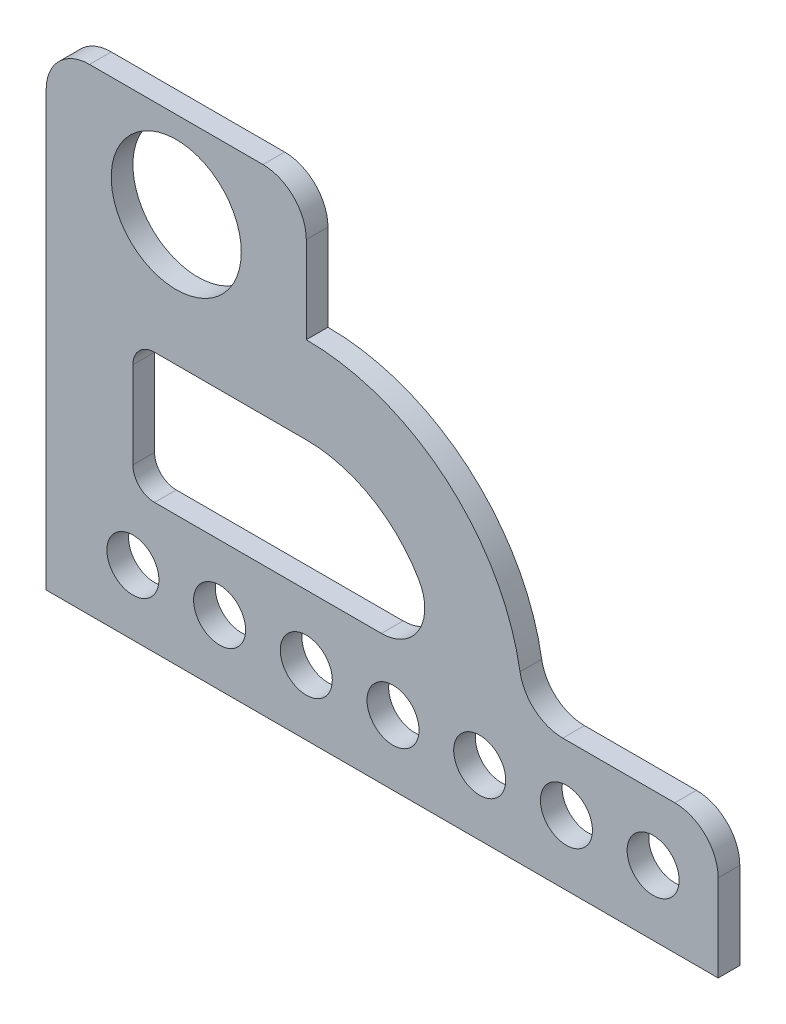
ISO-10303-21;
HEADER;
FILE_DESCRIPTION(('STEP AP214'),'2;1');
FILE_NAME('part.step','',(''),(''),'','','');
FILE_SCHEMA(('AUTOMOTIVE_DESIGN { 1 0 10303 214 1 1 1 1 }'));
ENDSEC;
DATA;
#1=APPLICATION_CONTEXT('core data for automotive mechanical design processes');
#2=APPLICATION_PROTOCOL_DEFINITION('international standard','automotive_design',2000,#1);
#3=PRODUCT_CONTEXT('',#1,'mechanical');
#4=PRODUCT('Part','Part','',(#3));
#5=PRODUCT_RELATED_PRODUCT_CATEGORY('part','',(#4));
#6=PRODUCT_DEFINITION_FORMATION('','',#4);
#7=PRODUCT_DEFINITION_CONTEXT('part definition',#1,'design');
#8=PRODUCT_DEFINITION('design','',#6,#7);
#9=PRODUCT_DEFINITION_SHAPE('','',#8);
#10=(LENGTH_UNIT() NAMED_UNIT(*) SI_UNIT(.MILLI.,.METRE.));
#11=(NAMED_UNIT(*) PLANE_ANGLE_UNIT() SI_UNIT($,.RADIAN.));
#12=(NAMED_UNIT(*) SI_UNIT($,.STERADIAN.) SOLID_ANGLE_UNIT());
#13=UNCERTAINTY_MEASURE_WITH_UNIT(LENGTH_MEASURE(1.E-05),#10,'distance_accuracy_value','');
#14=(GEOMETRIC_REPRESENTATION_CONTEXT(3) GLOBAL_UNCERTAINTY_ASSIGNED_CONTEXT((#13)) GLOBAL_UNIT_ASSIGNED_CONTEXT((#10,
#11,#12)) REPRESENTATION_CONTEXT('',''));
#15=CARTESIAN_POINT('',(0.,0.,0.));
#16=DIRECTION('',(0.,0.,1.));
#17=DIRECTION('',(1.,0.,0.));
#18=AXIS2_PLACEMENT_3D('',#15,#16,#17);
#19=CARTESIAN_POINT('',(-10.,20.,5.));
#20=DIRECTION('',(0.,0.,1.));
#21=DIRECTION('',(1.,0.,0.));
#22=AXIS2_PLACEMENT_3D('',#19,#20,#21);
#23=PLANE('',#22);
#24=CARTESIAN_POINT('',(-35.,15.,5.));
#25=DIRECTION('',(0.,0.,1.));
#26=DIRECTION('',(1.,0.,0.));
#27=AXIS2_PLACEMENT_3D('',#24,#25,#26);
#28=CIRCLE('',#27,6.00000000000002);
#29=CARTESIAN_POINT('',(-29.,15.,5.));
#30=VERTEX_POINT('',#29);
#31=EDGE_CURVE('E613',#30,#30,#28,.T.);
#32=ORIENTED_EDGE('',*,*,#31,.F.);
#33=EDGE_LOOP('',(#32));
#34=FACE_BOUND('',#33,.T.);
#35=CARTESIAN_POINT('',(-75.,15.,5.));
#36=DIRECTION('',(0.,0.,1.));
#37=DIRECTION('',(1.,0.,0.));
#38=AXIS2_PLACEMENT_3D('',#35,#36,#37);
#39=CIRCLE('',#38,6.00000000000002);
#40=CARTESIAN_POINT('',(-69.,15.,5.));
#41=VERTEX_POINT('',#40);
#42=EDGE_CURVE('E625',#41,#41,#39,.T.);
#43=ORIENTED_EDGE('',*,*,#42,.F.);
#44=EDGE_LOOP('',(#43));
#45=FACE_BOUND('',#44,.T.);
#46=CARTESIAN_POINT('',(-115.,15.,5.));
#47=DIRECTION('',(0.,0.,1.));
#48=DIRECTION('',(1.,0.,0.));
#49=AXIS2_PLACEMENT_3D('',#46,#47,#48);
#50=CIRCLE('',#49,6.00000000000002);
#51=CARTESIAN_POINT('',(-109.,15.,5.));
#52=VERTEX_POINT('',#51);
#53=EDGE_CURVE('E637',#52,#52,#50,.T.);
#54=ORIENTED_EDGE('',*,*,#53,.F.);
#55=EDGE_LOOP('',(#54));
#56=FACE_BOUND('',#55,.T.);
#57=CARTESIAN_POINT('',(-125.,90.,5.));
#58=DIRECTION('',(0.,0.,1.));
#59=DIRECTION('',(1.,0.,0.));
#60=AXIS2_PLACEMENT_3D('',#57,#58,#59);
#61=CIRCLE('',#60,15.);
#62=CARTESIAN_POINT('',(-110.,90.,5.));
#63=VERTEX_POINT('',#62);
#64=EDGE_CURVE('E193',#63,#63,#61,.T.);
#65=ORIENTED_EDGE('',*,*,#64,.F.);
#66=EDGE_LOOP('',(#65));
#67=FACE_BOUND('',#66,.T.);
#68=DIRECTION('',(0.,1.,0.));
#69=VECTOR('',#68,1.);
#70=CARTESIAN_POINT('',(0.,0.,5.));
#71=LINE('',#70,#69);
#72=CARTESIAN_POINT('',(0.,0.,5.));
#73=VERTEX_POINT('',#72);
#74=CARTESIAN_POINT('',(0.,19.9999999999999,5.));
#75=VERTEX_POINT('',#74);
#76=EDGE_CURVE('E219',#73,#75,#71,.T.);
#77=ORIENTED_EDGE('',*,*,#76,.T.);
#78=CARTESIAN_POINT('',(-10.,20.,5.));
#79=DIRECTION('',(0.,0.,1.));
#80=DIRECTION('',(1.,0.,0.));
#81=AXIS2_PLACEMENT_3D('',#78,#79,#80);
#82=CIRCLE('',#81,10.);
#83=CARTESIAN_POINT('',(-10.0000000000001,30.,5.));
#84=VERTEX_POINT('',#83);
#85=EDGE_CURVE('E222',#75,#84,#82,.T.);
#86=ORIENTED_EDGE('',*,*,#85,.T.);
#87=DIRECTION('',(-1.,0.,0.));
#88=VECTOR('',#87,1.);
#89=CARTESIAN_POINT('',(-35.8392021690038,30.,5.));
#90=LINE('',#89,#88);
#91=CARTESIAN_POINT('',(-35.8392021690038,30.,5.));
#92=VERTEX_POINT('',#91);
#93=EDGE_CURVE('E225',#84,#92,#90,.T.);
#94=ORIENTED_EDGE('',*,*,#93,.T.);
#95=CARTESIAN_POINT('',(-35.8392021690038,40.,5.));
#96=DIRECTION('',(0.,0.,-1.));
#97=DIRECTION('',(-1.,0.,0.));
#98=AXIS2_PLACEMENT_3D('',#95,#96,#97);
#99=CIRCLE('',#98,9.99999999999999);
#100=CARTESIAN_POINT('',(-45.6993351408365,38.3333333333333,5.));
#101=VERTEX_POINT('',#100);
#102=EDGE_CURVE('E227',#92,#101,#99,.T.);
#103=ORIENTED_EDGE('',*,*,#102,.T.);
#104=CARTESIAN_POINT('',(-95.,30.,5.));
#105=DIRECTION('',(0.,0.,1.));
#106=DIRECTION('',(1.,0.,0.));
#107=AXIS2_PLACEMENT_3D('',#104,#105,#106);
#108=CIRCLE('',#107,50.);
#109=CARTESIAN_POINT('',(-95.,80.,5.));
#110=VERTEX_POINT('',#109);
#111=EDGE_CURVE('E229',#101,#110,#108,.T.);
#112=ORIENTED_EDGE('',*,*,#111,.T.);
#113=DIRECTION('',(0.,1.,0.));
#114=VECTOR('',#113,1.);
#115=CARTESIAN_POINT('',(-95.,99.9999999999999,5.));
#116=LINE('',#115,#114);
#117=CARTESIAN_POINT('',(-95.,99.9999999999999,5.));
#118=VERTEX_POINT('',#117);
#119=EDGE_CURVE('E231',#110,#118,#116,.T.);
#120=ORIENTED_EDGE('',*,*,#119,.T.);
#121=CARTESIAN_POINT('',(-105.,100.,5.));
#122=DIRECTION('',(0.,0.,1.));
#123=DIRECTION('',(-1.,0.,0.));
#124=AXIS2_PLACEMENT_3D('',#121,#122,#123);
#125=CIRCLE('',#124,9.99999999999999);
#126=CARTESIAN_POINT('',(-105.,110.,5.));
#127=VERTEX_POINT('',#126);
#128=EDGE_CURVE('E233',#118,#127,#125,.T.);
#129=ORIENTED_EDGE('',*,*,#128,.T.);
#130=DIRECTION('',(-1.,0.,0.));
#131=VECTOR('',#130,1.);
#132=CARTESIAN_POINT('',(-145.,110.,5.));
#133=LINE('',#132,#131);
#134=CARTESIAN_POINT('',(-145.,110.,5.));
#135=VERTEX_POINT('',#134);
#136=EDGE_CURVE('E235',#127,#135,#133,.T.);
#137=ORIENTED_EDGE('',*,*,#136,.T.);
#138=CARTESIAN_POINT('',(-145.,100.,5.));
#139=DIRECTION('',(0.,0.,1.));
#140=DIRECTION('',(-1.,0.,0.));
#141=AXIS2_PLACEMENT_3D('',#138,#139,#140);
#142=CIRCLE('',#141,10.);
#143=CARTESIAN_POINT('',(-155.,99.9999999999999,5.));
#144=VERTEX_POINT('',#143);
#145=EDGE_CURVE('E237',#135,#144,#142,.T.);
#146=ORIENTED_EDGE('',*,*,#145,.T.);
#147=DIRECTION('',(0.,-1.,0.));
#148=VECTOR('',#147,1.);
#149=CARTESIAN_POINT('',(-155.,0.,5.));
#150=LINE('',#149,#148);
#151=CARTESIAN_POINT('',(-155.,0.,5.));
#152=VERTEX_POINT('',#151);
#153=EDGE_CURVE('E239',#144,#152,#150,.T.);
#154=ORIENTED_EDGE('',*,*,#153,.T.);
#155=DIRECTION('',(1.,0.,0.));
#156=VECTOR('',#155,1.);
#157=CARTESIAN_POINT('',(0.,0.,5.));
#158=LINE('',#157,#156);
#159=EDGE_CURVE('E241',#152,#73,#158,.T.);
#160=ORIENTED_EDGE('',*,*,#159,.T.);
#161=EDGE_LOOP('',(#77,#86,#94,#103,#112,#120,#129,#137,#146,#154,#160));
#162=FACE_BOUND('',#161,.T.);
#163=CARTESIAN_POINT('',(-95.,30.,5.));
#164=DIRECTION('',(0.,0.,1.));
#165=DIRECTION('',(1.,0.,0.));
#166=AXIS2_PLACEMENT_3D('',#163,#164,#165);
#167=CIRCLE('',#166,30.);
#168=CARTESIAN_POINT('',(-69.0192378864668,45.,5.));
#169=VERTEX_POINT('',#168);
#170=CARTESIAN_POINT('',(-95.,60.,5.));
#171=VERTEX_POINT('',#170);
#172=EDGE_CURVE('E178',#169,#171,#167,.T.);
#173=ORIENTED_EDGE('',*,*,#172,.F.);
#174=CARTESIAN_POINT('',(-77.6794919243112,40.,5.));
#175=DIRECTION('',(0.,0.,1.));
#176=DIRECTION('',(1.,0.,0.));
#177=AXIS2_PLACEMENT_3D('',#174,#175,#176);
#178=CIRCLE('',#177,10.);
#179=CARTESIAN_POINT('',(-77.6794919243112,30.,5.));
#180=VERTEX_POINT('',#179);
#181=EDGE_CURVE('E163',#180,#169,#178,.T.);
#182=ORIENTED_EDGE('',*,*,#181,.F.);
#183=DIRECTION('',(1.,0.,0.));
#184=VECTOR('',#183,1.);
#185=CARTESIAN_POINT('',(-95.,30.,5.));
#186=LINE('',#185,#184);
#187=CARTESIAN_POINT('',(-130.,30.,5.));
#188=VERTEX_POINT('',#187);
#189=EDGE_CURVE('E158',#188,#180,#186,.T.);
#190=ORIENTED_EDGE('',*,*,#189,.F.);
#191=CARTESIAN_POINT('',(-130.,35.,5.));
#192=DIRECTION('',(0.,0.,1.));
#193=DIRECTION('',(-1.,0.,0.));
#194=AXIS2_PLACEMENT_3D('',#191,#192,#193);
#195=CIRCLE('',#194,5.);
#196=CARTESIAN_POINT('',(-135.,35.,5.));
#197=VERTEX_POINT('',#196);
#198=EDGE_CURVE('E189',#197,#188,#195,.T.);
#199=ORIENTED_EDGE('',*,*,#198,.F.);
#200=DIRECTION('',(0.,-1.,0.));
#201=VECTOR('',#200,1.);
#202=CARTESIAN_POINT('',(-135.,55.,5.));
#203=LINE('',#202,#201);
#204=CARTESIAN_POINT('',(-135.,55.,5.));
#205=VERTEX_POINT('',#204);
#206=EDGE_CURVE('E187',#205,#197,#203,.T.);
#207=ORIENTED_EDGE('',*,*,#206,.F.);
#208=CARTESIAN_POINT('',(-130.,55.,5.));
#209=DIRECTION('',(0.,0.,1.));
#210=DIRECTION('',(-1.,0.,0.));
#211=AXIS2_PLACEMENT_3D('',#208,#209,#210);
#212=CIRCLE('',#211,5.);
#213=CARTESIAN_POINT('',(-130.,60.,5.));
#214=VERTEX_POINT('',#213);
#215=EDGE_CURVE('E185',#214,#205,#212,.T.);
#216=ORIENTED_EDGE('',*,*,#215,.F.);
#217=DIRECTION('',(-1.,0.,0.));
#218=VECTOR('',#217,1.);
#219=CARTESIAN_POINT('',(-95.,60.,5.));
#220=LINE('',#219,#218);
#221=EDGE_CURVE('E180',#171,#214,#220,.T.);
#222=ORIENTED_EDGE('',*,*,#221,.F.);
#223=EDGE_LOOP('',(#173,#182,#190,#199,#207,#216,#222));
#224=FACE_BOUND('',#223,.T.);
#225=CARTESIAN_POINT('',(-135.,15.,5.));
#226=DIRECTION('',(0.,0.,1.));
#227=DIRECTION('',(1.,0.,0.));
#228=AXIS2_PLACEMENT_3D('',#225,#226,#227);
#229=CIRCLE('',#228,6.00000000000002);
#230=CARTESIAN_POINT('',(-129.,15.,5.));
#231=VERTEX_POINT('',#230);
#232=EDGE_CURVE('E643',#231,#231,#229,.T.);
#233=ORIENTED_EDGE('',*,*,#232,.F.);
#234=EDGE_LOOP('',(#233));
#235=FACE_BOUND('',#234,.T.);
#236=CARTESIAN_POINT('',(-95.,15.,5.));
#237=DIRECTION('',(0.,0.,1.));
#238=DIRECTION('',(1.,0.,0.));
#239=AXIS2_PLACEMENT_3D('',#236,#237,#238);
#240=CIRCLE('',#239,6.00000000000002);
#241=CARTESIAN_POINT('',(-89.,15.,5.));
#242=VERTEX_POINT('',#241);
#243=EDGE_CURVE('E631',#242,#242,#240,.T.);
#244=ORIENTED_EDGE('',*,*,#243,.F.);
#245=EDGE_LOOP('',(#244));
#246=FACE_BOUND('',#245,.T.);
#247=CARTESIAN_POINT('',(-55.,15.,5.));
#248=DIRECTION('',(0.,0.,1.));
#249=DIRECTION('',(1.,0.,0.));
#250=AXIS2_PLACEMENT_3D('',#247,#248,#249);
#251=CIRCLE('',#250,6.00000000000002);
#252=CARTESIAN_POINT('',(-49.,15.,5.));
#253=VERTEX_POINT('',#252);
#254=EDGE_CURVE('E619',#253,#253,#251,.T.);
#255=ORIENTED_EDGE('',*,*,#254,.F.);
#256=EDGE_LOOP('',(#255));
#257=FACE_BOUND('',#256,.T.);
#258=CARTESIAN_POINT('',(-15.,15.,5.));
#259=DIRECTION('',(0.,0.,1.));
#260=DIRECTION('',(1.,0.,0.));
#261=AXIS2_PLACEMENT_3D('',#258,#259,#260);
#262=CIRCLE('',#261,6.00000000000002);
#263=CARTESIAN_POINT('',(-8.99999999999997,15.,5.));
#264=VERTEX_POINT('',#263);
#265=EDGE_CURVE('E604',#264,#264,#262,.T.);
#266=ORIENTED_EDGE('',*,*,#265,.F.);
#267=EDGE_LOOP('',(#266));
#268=FACE_BOUND('',#267,.T.);
#269=ADVANCED_FACE('F36',(#34,#45,#56,#67,#162,#224,#235,#246,#257,#268),#23,.T.);
#270=CARTESIAN_POINT('',(-10.,20.,0.));
#271=DIRECTION('',(0.,0.,1.));
#272=DIRECTION('',(1.,0.,0.));
#273=AXIS2_PLACEMENT_3D('',#270,#271,#272);
#274=PLANE('',#273);
#275=DIRECTION('',(0.,1.,0.));
#276=VECTOR('',#275,1.);
#277=CARTESIAN_POINT('',(0.,0.,0.));
#278=LINE('',#277,#276);
#279=CARTESIAN_POINT('',(0.,0.,0.));
#280=VERTEX_POINT('',#279);
#281=CARTESIAN_POINT('',(0.,19.9999999999999,0.));
#282=VERTEX_POINT('',#281);
#283=EDGE_CURVE('E172',#280,#282,#278,.T.);
#284=ORIENTED_EDGE('',*,*,#283,.F.);
#285=DIRECTION('',(1.,0.,0.));
#286=VECTOR('',#285,1.);
#287=CARTESIAN_POINT('',(0.,0.,0.));
#288=LINE('',#287,#286);
#289=CARTESIAN_POINT('',(-155.,0.,0.));
#290=VERTEX_POINT('',#289);
#291=EDGE_CURVE('E223',#290,#280,#288,.T.);
#292=ORIENTED_EDGE('',*,*,#291,.F.);
#293=DIRECTION('',(0.,-1.,0.));
#294=VECTOR('',#293,1.);
#295=CARTESIAN_POINT('',(-155.,0.,0.));
#296=LINE('',#295,#294);
#297=CARTESIAN_POINT('',(-155.,99.9999999999999,0.));
#298=VERTEX_POINT('',#297);
#299=EDGE_CURVE('E262',#298,#290,#296,.T.);
#300=ORIENTED_EDGE('',*,*,#299,.F.);
#301=CARTESIAN_POINT('',(-145.,100.,0.));
#302=DIRECTION('',(0.,0.,1.));
#303=DIRECTION('',(-1.,0.,0.));
#304=AXIS2_PLACEMENT_3D('',#301,#302,#303);
#305=CIRCLE('',#304,10.);
#306=CARTESIAN_POINT('',(-145.,110.,0.));
#307=VERTEX_POINT('',#306);
#308=EDGE_CURVE('E260',#307,#298,#305,.T.);
#309=ORIENTED_EDGE('',*,*,#308,.F.);
#310=DIRECTION('',(-1.,0.,0.));
#311=VECTOR('',#310,1.);
#312=CARTESIAN_POINT('',(-145.,110.,0.));
#313=LINE('',#312,#311);
#314=CARTESIAN_POINT('',(-105.,110.,0.));
#315=VERTEX_POINT('',#314);
#316=EDGE_CURVE('E258',#315,#307,#313,.T.);
#317=ORIENTED_EDGE('',*,*,#316,.F.);
#318=CARTESIAN_POINT('',(-105.,100.,0.));
#319=DIRECTION('',(0.,0.,1.));
#320=DIRECTION('',(-1.,0.,0.));
#321=AXIS2_PLACEMENT_3D('',#318,#319,#320);
#322=CIRCLE('',#321,9.99999999999999);
#323=CARTESIAN_POINT('',(-95.,99.9999999999999,0.));
#324=VERTEX_POINT('',#323);
#325=EDGE_CURVE('E256',#324,#315,#322,.T.);
#326=ORIENTED_EDGE('',*,*,#325,.F.);
#327=DIRECTION('',(0.,1.,0.));
#328=VECTOR('',#327,1.);
#329=CARTESIAN_POINT('',(-95.,99.9999999999999,0.));
#330=LINE('',#329,#328);
#331=CARTESIAN_POINT('',(-95.,80.,0.));
#332=VERTEX_POINT('',#331);
#333=EDGE_CURVE('E254',#332,#324,#330,.T.);
#334=ORIENTED_EDGE('',*,*,#333,.F.);
#335=CARTESIAN_POINT('',(-95.,30.,0.));
#336=DIRECTION('',(0.,0.,1.));
#337=DIRECTION('',(1.,0.,0.));
#338=AXIS2_PLACEMENT_3D('',#335,#336,#337);
#339=CIRCLE('',#338,50.);
#340=CARTESIAN_POINT('',(-45.6993351408365,38.3333333333333,0.));
#341=VERTEX_POINT('',#340);
#342=EDGE_CURVE('E252',#341,#332,#339,.T.);
#343=ORIENTED_EDGE('',*,*,#342,.F.);
#344=CARTESIAN_POINT('',(-35.8392021690038,40.,0.));
#345=DIRECTION('',(0.,0.,-1.));
#346=DIRECTION('',(-1.,0.,0.));
#347=AXIS2_PLACEMENT_3D('',#344,#345,#346);
#348=CIRCLE('',#347,9.99999999999999);
#349=CARTESIAN_POINT('',(-35.8392021690038,30.,0.));
#350=VERTEX_POINT('',#349);
#351=EDGE_CURVE('E250',#350,#341,#348,.T.);
#352=ORIENTED_EDGE('',*,*,#351,.F.);
#353=DIRECTION('',(-1.,0.,0.));
#354=VECTOR('',#353,1.);
#355=CARTESIAN_POINT('',(-35.8392021690038,30.,0.));
#356=LINE('',#355,#354);
#357=CARTESIAN_POINT('',(-10.0000000000001,30.,0.));
#358=VERTEX_POINT('',#357);
#359=EDGE_CURVE('E248',#358,#350,#356,.T.);
#360=ORIENTED_EDGE('',*,*,#359,.F.);
#361=CARTESIAN_POINT('',(-10.,20.,0.));
#362=DIRECTION('',(0.,0.,1.));
#363=DIRECTION('',(1.,0.,0.));
#364=AXIS2_PLACEMENT_3D('',#361,#362,#363);
#365=CIRCLE('',#364,10.);
#366=EDGE_CURVE('E246',#282,#358,#365,.T.);
#367=ORIENTED_EDGE('',*,*,#366,.F.);
#368=EDGE_LOOP('',(#284,#292,#300,#309,#317,#326,#334,#343,#352,#360,#367));
#369=FACE_BOUND('',#368,.T.);
#370=CARTESIAN_POINT('',(-77.6794919243112,40.,0.));
#371=DIRECTION('',(0.,0.,1.));
#372=DIRECTION('',(1.,0.,0.));
#373=AXIS2_PLACEMENT_3D('',#370,#371,#372);
#374=CIRCLE('',#373,10.);
#375=CARTESIAN_POINT('',(-77.6794919243112,30.,0.));
#376=VERTEX_POINT('',#375);
#377=CARTESIAN_POINT('',(-69.0192378864668,45.,0.));
#378=VERTEX_POINT('',#377);
#379=EDGE_CURVE('E170',#376,#378,#374,.T.);
#380=ORIENTED_EDGE('',*,*,#379,.T.);
#381=CARTESIAN_POINT('',(-95.,30.,0.));
#382=DIRECTION('',(0.,0.,1.));
#383=DIRECTION('',(1.,0.,0.));
#384=AXIS2_PLACEMENT_3D('',#381,#382,#383);
#385=CIRCLE('',#384,30.);
#386=CARTESIAN_POINT('',(-95.,60.,0.));
#387=VERTEX_POINT('',#386);
#388=EDGE_CURVE('E192',#378,#387,#385,.T.);
#389=ORIENTED_EDGE('',*,*,#388,.T.);
#390=DIRECTION('',(-1.,0.,0.));
#391=VECTOR('',#390,1.);
#392=CARTESIAN_POINT('',(-95.,60.,0.));
#393=LINE('',#392,#391);
#394=CARTESIAN_POINT('',(-130.,60.,0.));
#395=VERTEX_POINT('',#394);
#396=EDGE_CURVE('E196',#387,#395,#393,.T.);
#397=ORIENTED_EDGE('',*,*,#396,.T.);
#398=CARTESIAN_POINT('',(-130.,55.,0.));
#399=DIRECTION('',(0.,0.,1.));
#400=DIRECTION('',(-1.,0.,0.));
#401=AXIS2_PLACEMENT_3D('',#398,#399,#400);
#402=CIRCLE('',#401,5.);
#403=CARTESIAN_POINT('',(-135.,55.,0.));
#404=VERTEX_POINT('',#403);
#405=EDGE_CURVE('E199',#395,#404,#402,.T.);
#406=ORIENTED_EDGE('',*,*,#405,.T.);
#407=DIRECTION('',(0.,-1.,0.));
#408=VECTOR('',#407,1.);
#409=CARTESIAN_POINT('',(-135.,55.,0.));
#410=LINE('',#409,#408);
#411=CARTESIAN_POINT('',(-135.,35.,0.));
#412=VERTEX_POINT('',#411);
#413=EDGE_CURVE('E202',#404,#412,#410,.T.);
#414=ORIENTED_EDGE('',*,*,#413,.T.);
#415=CARTESIAN_POINT('',(-130.,35.,0.));
#416=DIRECTION('',(0.,0.,1.));
#417=DIRECTION('',(-1.,0.,0.));
#418=AXIS2_PLACEMENT_3D('',#415,#416,#417);
#419=CIRCLE('',#418,5.);
#420=CARTESIAN_POINT('',(-130.,30.,0.));
#421=VERTEX_POINT('',#420);
#422=EDGE_CURVE('E205',#412,#421,#419,.T.);
#423=ORIENTED_EDGE('',*,*,#422,.T.);
#424=DIRECTION('',(1.,0.,0.));
#425=VECTOR('',#424,1.);
#426=CARTESIAN_POINT('',(-130.,30.,0.));
#427=LINE('',#426,#425);
#428=EDGE_CURVE('E164',#421,#376,#427,.T.);
#429=ORIENTED_EDGE('',*,*,#428,.T.);
#430=EDGE_LOOP('',(#380,#389,#397,#406,#414,#423,#429));
#431=FACE_BOUND('',#430,.T.);
#432=CARTESIAN_POINT('',(-125.,90.,0.));
#433=DIRECTION('',(0.,0.,1.));
#434=DIRECTION('',(1.,0.,0.));
#435=AXIS2_PLACEMENT_3D('',#432,#433,#434);
#436=CIRCLE('',#435,15.);
#437=CARTESIAN_POINT('',(-110.,90.,0.));
#438=VERTEX_POINT('',#437);
#439=EDGE_CURVE('E646',#438,#438,#436,.T.);
#440=ORIENTED_EDGE('',*,*,#439,.T.);
#441=EDGE_LOOP('',(#440));
#442=FACE_BOUND('',#441,.T.);
#443=CARTESIAN_POINT('',(-135.,15.,0.));
#444=DIRECTION('',(0.,0.,1.));
#445=DIRECTION('',(1.,0.,0.));
#446=AXIS2_PLACEMENT_3D('',#443,#444,#445);
#447=CIRCLE('',#446,6.00000000000002);
#448=CARTESIAN_POINT('',(-129.,15.,0.));
#449=VERTEX_POINT('',#448);
#450=EDGE_CURVE('E640',#449,#449,#447,.T.);
#451=ORIENTED_EDGE('',*,*,#450,.T.);
#452=EDGE_LOOP('',(#451));
#453=FACE_BOUND('',#452,.T.);
#454=CARTESIAN_POINT('',(-115.,15.,0.));
#455=DIRECTION('',(0.,0.,1.));
#456=DIRECTION('',(1.,0.,0.));
#457=AXIS2_PLACEMENT_3D('',#454,#455,#456);
#458=CIRCLE('',#457,6.00000000000002);
#459=CARTESIAN_POINT('',(-109.,15.,0.));
#460=VERTEX_POINT('',#459);
#461=EDGE_CURVE('E634',#460,#460,#458,.T.);
#462=ORIENTED_EDGE('',*,*,#461,.T.);
#463=EDGE_LOOP('',(#462));
#464=FACE_BOUND('',#463,.T.);
#465=CARTESIAN_POINT('',(-95.,15.,0.));
#466=DIRECTION('',(0.,0.,1.));
#467=DIRECTION('',(1.,0.,0.));
#468=AXIS2_PLACEMENT_3D('',#465,#466,#467);
#469=CIRCLE('',#468,6.00000000000002);
#470=CARTESIAN_POINT('',(-89.,15.,0.));
#471=VERTEX_POINT('',#470);
#472=EDGE_CURVE('E628',#471,#471,#469,.T.);
#473=ORIENTED_EDGE('',*,*,#472,.T.);
#474=EDGE_LOOP('',(#473));
#475=FACE_BOUND('',#474,.T.);
#476=CARTESIAN_POINT('',(-75.,15.,0.));
#477=DIRECTION('',(0.,0.,1.));
#478=DIRECTION('',(1.,0.,0.));
#479=AXIS2_PLACEMENT_3D('',#476,#477,#478);
#480=CIRCLE('',#479,6.00000000000002);
#481=CARTESIAN_POINT('',(-69.,15.,0.));
#482=VERTEX_POINT('',#481);
#483=EDGE_CURVE('E622',#482,#482,#480,.T.);
#484=ORIENTED_EDGE('',*,*,#483,.T.);
#485=EDGE_LOOP('',(#484));
#486=FACE_BOUND('',#485,.T.);
#487=CARTESIAN_POINT('',(-55.,15.,0.));
#488=DIRECTION('',(0.,0.,1.));
#489=DIRECTION('',(1.,0.,0.));
#490=AXIS2_PLACEMENT_3D('',#487,#488,#489);
#491=CIRCLE('',#490,6.00000000000002);
#492=CARTESIAN_POINT('',(-49.,15.,0.));
#493=VERTEX_POINT('',#492);
#494=EDGE_CURVE('E616',#493,#493,#491,.T.);
#495=ORIENTED_EDGE('',*,*,#494,.T.);
#496=EDGE_LOOP('',(#495));
#497=FACE_BOUND('',#496,.T.);
#498=CARTESIAN_POINT('',(-35.,15.,0.));
#499=DIRECTION('',(0.,0.,1.));
#500=DIRECTION('',(1.,0.,0.));
#501=AXIS2_PLACEMENT_3D('',#498,#499,#500);
#502=CIRCLE('',#501,6.00000000000002);
#503=CARTESIAN_POINT('',(-29.,15.,0.));
#504=VERTEX_POINT('',#503);
#505=EDGE_CURVE('E610',#504,#504,#502,.T.);
#506=ORIENTED_EDGE('',*,*,#505,.T.);
#507=EDGE_LOOP('',(#506));
#508=FACE_BOUND('',#507,.T.);
#509=CARTESIAN_POINT('',(-15.,15.,0.));
#510=DIRECTION('',(0.,0.,1.));
#511=DIRECTION('',(1.,0.,0.));
#512=AXIS2_PLACEMENT_3D('',#509,#510,#511);
#513=CIRCLE('',#512,6.00000000000002);
#514=CARTESIAN_POINT('',(-8.99999999999997,15.,0.));
#515=VERTEX_POINT('',#514);
#516=EDGE_CURVE('E607',#515,#515,#513,.T.);
#517=ORIENTED_EDGE('',*,*,#516,.T.);
#518=EDGE_LOOP('',(#517));
#519=FACE_BOUND('',#518,.T.);
#520=ADVANCED_FACE('F301',(#369,#431,#442,#453,#464,#475,#486,#497,#508,#519),#274,.F.);
#521=CARTESIAN_POINT('',(0.,0.,5.));
#522=DIRECTION('',(-1.,0.,0.));
#523=DIRECTION('',(0.,0.,1.));
#524=AXIS2_PLACEMENT_3D('',#521,#522,#523);
#525=PLANE('',#524);
#526=ORIENTED_EDGE('',*,*,#283,.T.);
#527=DIRECTION('',(0.,0.,-1.));
#528=VECTOR('',#527,1.);
#529=CARTESIAN_POINT('',(0.,19.9999999999999,5.));
#530=LINE('',#529,#528);
#531=EDGE_CURVE('E11',#75,#282,#530,.T.);
#532=ORIENTED_EDGE('',*,*,#531,.F.);
#533=ORIENTED_EDGE('',*,*,#76,.F.);
#534=DIRECTION('',(0.,0.,-1.));
#535=VECTOR('',#534,1.);
#536=CARTESIAN_POINT('',(0.,0.,5.));
#537=LINE('',#536,#535);
#538=EDGE_CURVE('E243',#73,#280,#537,.T.);
#539=ORIENTED_EDGE('',*,*,#538,.T.);
#540=EDGE_LOOP('',(#526,#532,#533,#539));
#541=FACE_BOUND('',#540,.T.);
#542=ADVANCED_FACE('F38',(#541),#525,.F.);
#543=CARTESIAN_POINT('',(-10.,20.,5.));
#544=DIRECTION('',(0.,0.,-1.));
#545=DIRECTION('',(-1.,0.,0.));
#546=AXIS2_PLACEMENT_3D('',#543,#544,#545);
#547=CYLINDRICAL_SURFACE('',#546,10.);
#548=ORIENTED_EDGE('',*,*,#366,.T.);
#549=DIRECTION('',(0.,0.,-1.));
#550=VECTOR('',#549,1.);
#551=CARTESIAN_POINT('',(-10.0000000000001,30.,5.));
#552=LINE('',#551,#550);
#553=EDGE_CURVE('E44',#84,#358,#552,.T.);
#554=ORIENTED_EDGE('',*,*,#553,.F.);
#555=ORIENTED_EDGE('',*,*,#85,.F.);
#556=ORIENTED_EDGE('',*,*,#531,.T.);
#557=EDGE_LOOP('',(#548,#554,#555,#556));
#558=FACE_BOUND('',#557,.T.);
#559=ADVANCED_FACE('F318',(#558),#547,.T.);
#560=CARTESIAN_POINT('',(-35.8392021690038,30.,5.));
#561=DIRECTION('',(0.,-1.,0.));
#562=DIRECTION('',(1.,0.,0.));
#563=AXIS2_PLACEMENT_3D('',#560,#561,#562);
#564=PLANE('',#563);
#565=ORIENTED_EDGE('',*,*,#359,.T.);
#566=DIRECTION('',(0.,0.,-1.));
#567=VECTOR('',#566,1.);
#568=CARTESIAN_POINT('',(-35.8392021690038,30.,5.));
#569=LINE('',#568,#567);
#570=EDGE_CURVE('E288',#92,#350,#569,.T.);
#571=ORIENTED_EDGE('',*,*,#570,.F.);
#572=ORIENTED_EDGE('',*,*,#93,.F.);
#573=ORIENTED_EDGE('',*,*,#553,.T.);
#574=EDGE_LOOP('',(#565,#571,#572,#573));
#575=FACE_BOUND('',#574,.T.);
#576=ADVANCED_FACE('F295',(#575),#564,.F.);
#577=CARTESIAN_POINT('',(-35.8392021690038,40.,5.));
#578=DIRECTION('',(0.,0.,-1.));
#579=DIRECTION('',(-1.,0.,0.));
#580=AXIS2_PLACEMENT_3D('',#577,#578,#579);
#581=CYLINDRICAL_SURFACE('',#580,9.99999999999999);
#582=ORIENTED_EDGE('',*,*,#351,.T.);
#583=DIRECTION('',(0.,0.,-1.));
#584=VECTOR('',#583,1.);
#585=CARTESIAN_POINT('',(-45.6993351408365,38.3333333333333,5.));
#586=LINE('',#585,#584);
#587=EDGE_CURVE('E285',#101,#341,#586,.T.);
#588=ORIENTED_EDGE('',*,*,#587,.F.);
#589=ORIENTED_EDGE('',*,*,#102,.F.);
#590=ORIENTED_EDGE('',*,*,#570,.T.);
#591=EDGE_LOOP('',(#582,#588,#589,#590));
#592=FACE_BOUND('',#591,.T.);
#593=ADVANCED_FACE('F307',(#592),#581,.F.);
#594=CARTESIAN_POINT('',(-95.,30.,5.));
#595=DIRECTION('',(0.,0.,-1.));
#596=DIRECTION('',(-1.,0.,0.));
#597=AXIS2_PLACEMENT_3D('',#594,#595,#596);
#598=CYLINDRICAL_SURFACE('',#597,50.);
#599=ORIENTED_EDGE('',*,*,#342,.T.);
#600=DIRECTION('',(0.,0.,-1.));
#601=VECTOR('',#600,1.);
#602=CARTESIAN_POINT('',(-95.,80.,5.));
#603=LINE('',#602,#601);
#604=EDGE_CURVE('E282',#110,#332,#603,.T.);
#605=ORIENTED_EDGE('',*,*,#604,.F.);
#606=ORIENTED_EDGE('',*,*,#111,.F.);
#607=ORIENTED_EDGE('',*,*,#587,.T.);
#608=EDGE_LOOP('',(#599,#605,#606,#607));
#609=FACE_BOUND('',#608,.T.);
#610=ADVANCED_FACE('F311',(#609),#598,.T.);
#611=CARTESIAN_POINT('',(-95.,99.9999999999999,5.));
#612=DIRECTION('',(-1.,0.,0.));
#613=DIRECTION('',(0.,0.,1.));
#614=AXIS2_PLACEMENT_3D('',#611,#612,#613);
#615=PLANE('',#614);
#616=ORIENTED_EDGE('',*,*,#333,.T.);
#617=DIRECTION('',(0.,0.,-1.));
#618=VECTOR('',#617,1.);
#619=CARTESIAN_POINT('',(-95.,99.9999999999999,5.));
#620=LINE('',#619,#618);
#621=EDGE_CURVE('E279',#118,#324,#620,.T.);
#622=ORIENTED_EDGE('',*,*,#621,.F.);
#623=ORIENTED_EDGE('',*,*,#119,.F.);
#624=ORIENTED_EDGE('',*,*,#604,.T.);
#625=EDGE_LOOP('',(#616,#622,#623,#624));
#626=FACE_BOUND('',#625,.T.);
#627=ADVANCED_FACE('F346',(#626),#615,.F.);
#628=CARTESIAN_POINT('',(-105.,100.,5.));
#629=DIRECTION('',(0.,0.,-1.));
#630=DIRECTION('',(-1.,0.,0.));
#631=AXIS2_PLACEMENT_3D('',#628,#629,#630);
#632=CYLINDRICAL_SURFACE('',#631,9.99999999999999);
#633=ORIENTED_EDGE('',*,*,#325,.T.);
#634=DIRECTION('',(0.,0.,-1.));
#635=VECTOR('',#634,1.);
#636=CARTESIAN_POINT('',(-105.,110.,5.));
#637=LINE('',#636,#635);
#638=EDGE_CURVE('E276',#127,#315,#637,.T.);
#639=ORIENTED_EDGE('',*,*,#638,.F.);
#640=ORIENTED_EDGE('',*,*,#128,.F.);
#641=ORIENTED_EDGE('',*,*,#621,.T.);
#642=EDGE_LOOP('',(#633,#639,#640,#641));
#643=FACE_BOUND('',#642,.T.);
#644=ADVANCED_FACE('F344',(#643),#632,.T.);
#645=CARTESIAN_POINT('',(-145.,110.,5.));
#646=DIRECTION('',(0.,-1.,0.));
#647=DIRECTION('',(0.,0.,-1.));
#648=AXIS2_PLACEMENT_3D('',#645,#646,#647);
#649=PLANE('',#648);
#650=ORIENTED_EDGE('',*,*,#316,.T.);
#651=DIRECTION('',(0.,0.,-1.));
#652=VECTOR('',#651,1.);
#653=CARTESIAN_POINT('',(-145.,110.,5.));
#654=LINE('',#653,#652);
#655=EDGE_CURVE('E273',#135,#307,#654,.T.);
#656=ORIENTED_EDGE('',*,*,#655,.F.);
#657=ORIENTED_EDGE('',*,*,#136,.F.);
#658=ORIENTED_EDGE('',*,*,#638,.T.);
#659=EDGE_LOOP('',(#650,#656,#657,#658));
#660=FACE_BOUND('',#659,.T.);
#661=ADVANCED_FACE('F339',(#660),#649,.F.);
#662=CARTESIAN_POINT('',(-145.,100.,5.));
#663=DIRECTION('',(0.,0.,-1.));
#664=DIRECTION('',(-1.,0.,0.));
#665=AXIS2_PLACEMENT_3D('',#662,#663,#664);
#666=CYLINDRICAL_SURFACE('',#665,10.);
#667=ORIENTED_EDGE('',*,*,#308,.T.);
#668=DIRECTION('',(0.,0.,-1.));
#669=VECTOR('',#668,1.);
#670=CARTESIAN_POINT('',(-155.,99.9999999999999,5.));
#671=LINE('',#670,#669);
#672=EDGE_CURVE('E270',#144,#298,#671,.T.);
#673=ORIENTED_EDGE('',*,*,#672,.F.);
#674=ORIENTED_EDGE('',*,*,#145,.F.);
#675=ORIENTED_EDGE('',*,*,#655,.T.);
#676=EDGE_LOOP('',(#667,#673,#674,#675));
#677=FACE_BOUND('',#676,.T.);
#678=ADVANCED_FACE('F334',(#677),#666,.T.);
#679=CARTESIAN_POINT('',(-155.,0.,5.));
#680=DIRECTION('',(1.,0.,0.));
#681=DIRECTION('',(0.,0.,-1.));
#682=AXIS2_PLACEMENT_3D('',#679,#680,#681);
#683=PLANE('',#682);
#684=ORIENTED_EDGE('',*,*,#299,.T.);
#685=DIRECTION('',(0.,0.,-1.));
#686=VECTOR('',#685,1.);
#687=CARTESIAN_POINT('',(-155.,0.,5.));
#688=LINE('',#687,#686);
#689=EDGE_CURVE('E267',#152,#290,#688,.T.);
#690=ORIENTED_EDGE('',*,*,#689,.F.);
#691=ORIENTED_EDGE('',*,*,#153,.F.);
#692=ORIENTED_EDGE('',*,*,#672,.T.);
#693=EDGE_LOOP('',(#684,#690,#691,#692));
#694=FACE_BOUND('',#693,.T.);
#695=ADVANCED_FACE('F330',(#694),#683,.F.);
#696=CARTESIAN_POINT('',(0.,0.,5.));
#697=DIRECTION('',(0.,1.,0.));
#698=DIRECTION('',(-1.,0.,0.));
#699=AXIS2_PLACEMENT_3D('',#696,#697,#698);
#700=PLANE('',#699);
#701=ORIENTED_EDGE('',*,*,#291,.T.);
#702=ORIENTED_EDGE('',*,*,#538,.F.);
#703=ORIENTED_EDGE('',*,*,#159,.F.);
#704=ORIENTED_EDGE('',*,*,#689,.T.);
#705=EDGE_LOOP('',(#701,#702,#703,#704));
#706=FACE_BOUND('',#705,.T.);
#707=ADVANCED_FACE('F325',(#706),#700,.F.);
#708=CARTESIAN_POINT('',(-77.6794919243112,40.,5.));
#709=DIRECTION('',(0.,0.,-1.));
#710=DIRECTION('',(-1.,0.,0.));
#711=AXIS2_PLACEMENT_3D('',#708,#709,#710);
#712=CYLINDRICAL_SURFACE('',#711,10.);
#713=ORIENTED_EDGE('',*,*,#379,.F.);
#714=DIRECTION('',(0.,0.,-1.));
#715=VECTOR('',#714,1.);
#716=CARTESIAN_POINT('',(-77.6794919243112,30.,5.));
#717=LINE('',#716,#715);
#718=EDGE_CURVE('E56',#180,#376,#717,.T.);
#719=ORIENTED_EDGE('',*,*,#718,.F.);
#720=ORIENTED_EDGE('',*,*,#181,.T.);
#721=DIRECTION('',(0.,0.,-1.));
#722=VECTOR('',#721,1.);
#723=CARTESIAN_POINT('',(-69.0192378864668,45.,5.));
#724=LINE('',#723,#722);
#725=EDGE_CURVE('E173',#169,#378,#724,.T.);
#726=ORIENTED_EDGE('',*,*,#725,.T.);
#727=EDGE_LOOP('',(#713,#719,#720,#726));
#728=FACE_BOUND('',#727,.T.);
#729=ADVANCED_FACE('F167',(#728),#712,.F.);
#730=CARTESIAN_POINT('',(-95.,30.,5.));
#731=DIRECTION('',(0.,0.,-1.));
#732=DIRECTION('',(-1.,0.,0.));
#733=AXIS2_PLACEMENT_3D('',#730,#731,#732);
#734=CYLINDRICAL_SURFACE('',#733,30.);
#735=ORIENTED_EDGE('',*,*,#388,.F.);
#736=ORIENTED_EDGE('',*,*,#725,.F.);
#737=ORIENTED_EDGE('',*,*,#172,.T.);
#738=DIRECTION('',(0.,0.,-1.));
#739=VECTOR('',#738,1.);
#740=CARTESIAN_POINT('',(-95.,60.,5.));
#741=LINE('',#740,#739);
#742=EDGE_CURVE('E216',#171,#387,#741,.T.);
#743=ORIENTED_EDGE('',*,*,#742,.T.);
#744=EDGE_LOOP('',(#735,#736,#737,#743));
#745=FACE_BOUND('',#744,.T.);
#746=ADVANCED_FACE('F396',(#745),#734,.F.);
#747=CARTESIAN_POINT('',(-95.,60.,5.));
#748=DIRECTION('',(0.,-1.,0.));
#749=DIRECTION('',(1.,0.,0.));
#750=AXIS2_PLACEMENT_3D('',#747,#748,#749);
#751=PLANE('',#750);
#752=ORIENTED_EDGE('',*,*,#396,.F.);
#753=ORIENTED_EDGE('',*,*,#742,.F.);
#754=ORIENTED_EDGE('',*,*,#221,.T.);
#755=DIRECTION('',(0.,0.,-1.));
#756=VECTOR('',#755,1.);
#757=CARTESIAN_POINT('',(-130.,60.,5.));
#758=LINE('',#757,#756);
#759=EDGE_CURVE('E214',#214,#395,#758,.T.);
#760=ORIENTED_EDGE('',*,*,#759,.T.);
#761=EDGE_LOOP('',(#752,#753,#754,#760));
#762=FACE_BOUND('',#761,.T.);
#763=ADVANCED_FACE('F402',(#762),#751,.T.);
#764=CARTESIAN_POINT('',(-130.,55.,5.));
#765=DIRECTION('',(0.,0.,-1.));
#766=DIRECTION('',(-1.,0.,0.));
#767=AXIS2_PLACEMENT_3D('',#764,#765,#766);
#768=CYLINDRICAL_SURFACE('',#767,5.);
#769=ORIENTED_EDGE('',*,*,#405,.F.);
#770=ORIENTED_EDGE('',*,*,#759,.F.);
#771=ORIENTED_EDGE('',*,*,#215,.T.);
#772=DIRECTION('',(0.,0.,-1.));
#773=VECTOR('',#772,1.);
#774=CARTESIAN_POINT('',(-135.,55.,5.));
#775=LINE('',#774,#773);
#776=EDGE_CURVE('E212',#205,#404,#775,.T.);
#777=ORIENTED_EDGE('',*,*,#776,.T.);
#778=EDGE_LOOP('',(#769,#770,#771,#777));
#779=FACE_BOUND('',#778,.T.);
#780=ADVANCED_FACE('F409',(#779),#768,.F.);
#781=CARTESIAN_POINT('',(-135.,55.,5.));
#782=DIRECTION('',(1.,0.,0.));
#783=DIRECTION('',(0.,0.,-1.));
#784=AXIS2_PLACEMENT_3D('',#781,#782,#783);
#785=PLANE('',#784);
#786=ORIENTED_EDGE('',*,*,#413,.F.);
#787=ORIENTED_EDGE('',*,*,#776,.F.);
#788=ORIENTED_EDGE('',*,*,#206,.T.);
#789=DIRECTION('',(0.,0.,-1.));
#790=VECTOR('',#789,1.);
#791=CARTESIAN_POINT('',(-135.,35.,5.));
#792=LINE('',#791,#790);
#793=EDGE_CURVE('E210',#197,#412,#792,.T.);
#794=ORIENTED_EDGE('',*,*,#793,.T.);
#795=EDGE_LOOP('',(#786,#787,#788,#794));
#796=FACE_BOUND('',#795,.T.);
#797=ADVANCED_FACE('F417',(#796),#785,.T.);
#798=CARTESIAN_POINT('',(-130.,35.,5.));
#799=DIRECTION('',(0.,0.,-1.));
#800=DIRECTION('',(-1.,0.,0.));
#801=AXIS2_PLACEMENT_3D('',#798,#799,#800);
#802=CYLINDRICAL_SURFACE('',#801,5.);
#803=ORIENTED_EDGE('',*,*,#422,.F.);
#804=ORIENTED_EDGE('',*,*,#793,.F.);
#805=ORIENTED_EDGE('',*,*,#198,.T.);
#806=DIRECTION('',(0.,0.,-1.));
#807=VECTOR('',#806,1.);
#808=CARTESIAN_POINT('',(-130.,30.,5.));
#809=LINE('',#808,#807);
#810=EDGE_CURVE('E51',#188,#421,#809,.T.);
#811=ORIENTED_EDGE('',*,*,#810,.T.);
#812=EDGE_LOOP('',(#803,#804,#805,#811));
#813=FACE_BOUND('',#812,.T.);
#814=ADVANCED_FACE('F425',(#813),#802,.F.);
#815=CARTESIAN_POINT('',(-130.,30.,5.));
#816=DIRECTION('',(0.,1.,0.));
#817=DIRECTION('',(0.,0.,1.));
#818=AXIS2_PLACEMENT_3D('',#815,#816,#817);
#819=PLANE('',#818);
#820=ORIENTED_EDGE('',*,*,#428,.F.);
#821=ORIENTED_EDGE('',*,*,#810,.F.);
#822=ORIENTED_EDGE('',*,*,#189,.T.);
#823=ORIENTED_EDGE('',*,*,#718,.T.);
#824=EDGE_LOOP('',(#820,#821,#822,#823));
#825=FACE_BOUND('',#824,.T.);
#826=ADVANCED_FACE('F159',(#825),#819,.T.);
#827=CARTESIAN_POINT('',(-125.,90.,5.));
#828=DIRECTION('',(0.,0.,-1.));
#829=DIRECTION('',(-1.,0.,0.));
#830=AXIS2_PLACEMENT_3D('',#827,#828,#829);
#831=CYLINDRICAL_SURFACE('',#830,15.);
#832=ORIENTED_EDGE('',*,*,#64,.T.);
#833=EDGE_LOOP('',(#832));
#834=FACE_BOUND('',#833,.T.);
#835=ORIENTED_EDGE('',*,*,#439,.F.);
#836=EDGE_LOOP('',(#835));
#837=FACE_BOUND('',#836,.T.);
#838=ADVANCED_FACE('F440',(#834,#837),#831,.F.);
#839=CARTESIAN_POINT('',(-135.,15.,5.));
#840=DIRECTION('',(0.,0.,-1.));
#841=DIRECTION('',(-1.,0.,0.));
#842=AXIS2_PLACEMENT_3D('',#839,#840,#841);
#843=CYLINDRICAL_SURFACE('',#842,6.00000000000002);
#844=ORIENTED_EDGE('',*,*,#232,.T.);
#845=EDGE_LOOP('',(#844));
#846=FACE_BOUND('',#845,.T.);
#847=ORIENTED_EDGE('',*,*,#450,.F.);
#848=EDGE_LOOP('',(#847));
#849=FACE_BOUND('',#848,.T.);
#850=ADVANCED_FACE('F447',(#846,#849),#843,.F.);
#851=CARTESIAN_POINT('',(-115.,15.,5.));
#852=DIRECTION('',(0.,0.,-1.));
#853=DIRECTION('',(-1.,0.,0.));
#854=AXIS2_PLACEMENT_3D('',#851,#852,#853);
#855=CYLINDRICAL_SURFACE('',#854,6.00000000000002);
#856=ORIENTED_EDGE('',*,*,#53,.T.);
#857=EDGE_LOOP('',(#856));
#858=FACE_BOUND('',#857,.T.);
#859=ORIENTED_EDGE('',*,*,#461,.F.);
#860=EDGE_LOOP('',(#859));
#861=FACE_BOUND('',#860,.T.);
#862=ADVANCED_FACE('F455',(#858,#861),#855,.F.);
#863=CARTESIAN_POINT('',(-95.,15.,5.));
#864=DIRECTION('',(0.,0.,-1.));
#865=DIRECTION('',(-1.,0.,0.));
#866=AXIS2_PLACEMENT_3D('',#863,#864,#865);
#867=CYLINDRICAL_SURFACE('',#866,6.00000000000002);
#868=ORIENTED_EDGE('',*,*,#243,.T.);
#869=EDGE_LOOP('',(#868));
#870=FACE_BOUND('',#869,.T.);
#871=ORIENTED_EDGE('',*,*,#472,.F.);
#872=EDGE_LOOP('',(#871));
#873=FACE_BOUND('',#872,.T.);
#874=ADVANCED_FACE('F463',(#870,#873),#867,.F.);
#875=CARTESIAN_POINT('',(-75.,15.,5.));
#876=DIRECTION('',(0.,0.,-1.));
#877=DIRECTION('',(-1.,0.,0.));
#878=AXIS2_PLACEMENT_3D('',#875,#876,#877);
#879=CYLINDRICAL_SURFACE('',#878,6.00000000000002);
#880=ORIENTED_EDGE('',*,*,#42,.T.);
#881=EDGE_LOOP('',(#880));
#882=FACE_BOUND('',#881,.T.);
#883=ORIENTED_EDGE('',*,*,#483,.F.);
#884=EDGE_LOOP('',(#883));
#885=FACE_BOUND('',#884,.T.);
#886=ADVANCED_FACE('F471',(#882,#885),#879,.F.);
#887=CARTESIAN_POINT('',(-55.,15.,5.));
#888=DIRECTION('',(0.,0.,-1.));
#889=DIRECTION('',(-1.,0.,0.));
#890=AXIS2_PLACEMENT_3D('',#887,#888,#889);
#891=CYLINDRICAL_SURFACE('',#890,6.00000000000002);
#892=ORIENTED_EDGE('',*,*,#254,.T.);
#893=EDGE_LOOP('',(#892));
#894=FACE_BOUND('',#893,.T.);
#895=ORIENTED_EDGE('',*,*,#494,.F.);
#896=EDGE_LOOP('',(#895));
#897=FACE_BOUND('',#896,.T.);
#898=ADVANCED_FACE('F479',(#894,#897),#891,.F.);
#899=CARTESIAN_POINT('',(-35.,15.,5.));
#900=DIRECTION('',(0.,0.,-1.));
#901=DIRECTION('',(-1.,0.,0.));
#902=AXIS2_PLACEMENT_3D('',#899,#900,#901);
#903=CYLINDRICAL_SURFACE('',#902,6.00000000000002);
#904=ORIENTED_EDGE('',*,*,#31,.T.);
#905=EDGE_LOOP('',(#904));
#906=FACE_BOUND('',#905,.T.);
#907=ORIENTED_EDGE('',*,*,#505,.F.);
#908=EDGE_LOOP('',(#907));
#909=FACE_BOUND('',#908,.T.);
#910=ADVANCED_FACE('F487',(#906,#909),#903,.F.);
#911=CARTESIAN_POINT('',(-15.,15.,5.));
#912=DIRECTION('',(0.,0.,-1.));
#913=DIRECTION('',(-1.,0.,0.));
#914=AXIS2_PLACEMENT_3D('',#911,#912,#913);
#915=CYLINDRICAL_SURFACE('',#914,6.00000000000002);
#916=ORIENTED_EDGE('',*,*,#265,.T.);
#917=EDGE_LOOP('',(#916));
#918=FACE_BOUND('',#917,.T.);
#919=ORIENTED_EDGE('',*,*,#516,.F.);
#920=EDGE_LOOP('',(#919));
#921=FACE_BOUND('',#920,.T.);
#922=ADVANCED_FACE('F495',(#918,#921),#915,.F.);
#923=CLOSED_SHELL('',(#269,#520,#542,#559,#576,#593,#610,#627,#644,#661,#678,#695,#707,#729,
#746,#763,#780,#797,#814,#826,#838,#850,#862,#874,#886,#898,#910,#922));
#924=MANIFOLD_SOLID_BREP('B2',#923);
#925=ADVANCED_BREP_SHAPE_REPRESENTATION('',(#18,#924),#14);
#926=SHAPE_DEFINITION_REPRESENTATION(#9,#925);
ENDSEC;
END-ISO-10303-21;
